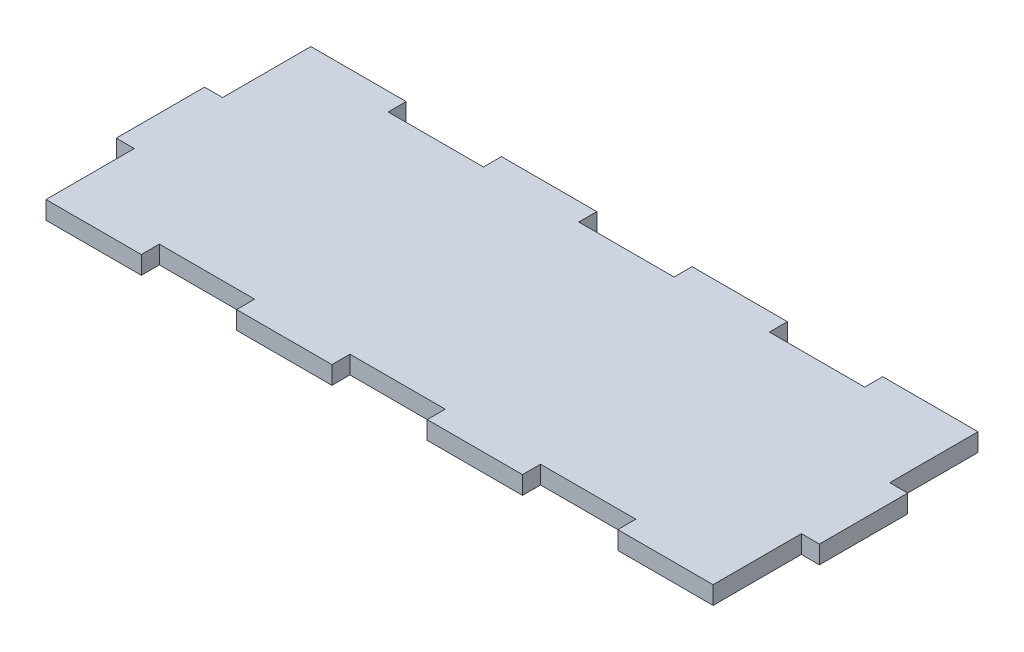
ISO-10303-21;
HEADER;
FILE_DESCRIPTION(('STEP AP214'),'2;1');
FILE_NAME('part.step','',(''),(''),'','','');
FILE_SCHEMA(('AUTOMOTIVE_DESIGN { 1 0 10303 214 1 1 1 1 }'));
ENDSEC;
DATA;
#1=APPLICATION_CONTEXT('core data for automotive mechanical design processes');
#2=APPLICATION_PROTOCOL_DEFINITION('international standard','automotive_design',2000,#1);
#3=PRODUCT_CONTEXT('',#1,'mechanical');
#4=PRODUCT('Part','Part','',(#3));
#5=PRODUCT_RELATED_PRODUCT_CATEGORY('part','',(#4));
#6=PRODUCT_DEFINITION_FORMATION('','',#4);
#7=PRODUCT_DEFINITION_CONTEXT('part definition',#1,'design');
#8=PRODUCT_DEFINITION('design','',#6,#7);
#9=PRODUCT_DEFINITION_SHAPE('','',#8);
#10=(LENGTH_UNIT() NAMED_UNIT(*) SI_UNIT(.MILLI.,.METRE.));
#11=(NAMED_UNIT(*) PLANE_ANGLE_UNIT() SI_UNIT($,.RADIAN.));
#12=(NAMED_UNIT(*) SI_UNIT($,.STERADIAN.) SOLID_ANGLE_UNIT());
#13=UNCERTAINTY_MEASURE_WITH_UNIT(LENGTH_MEASURE(1.E-05),#10,'distance_accuracy_value','');
#14=(GEOMETRIC_REPRESENTATION_CONTEXT(3) GLOBAL_UNCERTAINTY_ASSIGNED_CONTEXT((#13)) GLOBAL_UNIT_ASSIGNED_CONTEXT((#10,
#11,#12)) REPRESENTATION_CONTEXT('',''));
#15=CARTESIAN_POINT('',(0.,0.,0.));
#16=DIRECTION('',(0.,0.,1.));
#17=DIRECTION('',(1.,0.,0.));
#18=AXIS2_PLACEMENT_3D('',#15,#16,#17);
#19=CARTESIAN_POINT('',(68.5,1.85,0.));
#20=DIRECTION('',(-1.,0.,0.));
#21=DIRECTION('',(0.,0.,1.));
#22=AXIS2_PLACEMENT_3D('',#19,#20,#21);
#23=PLANE('',#22);
#24=DIRECTION('',(0.,1.,0.));
#25=VECTOR('',#24,1.);
#26=CARTESIAN_POINT('',(68.5,-9.95905136454435,-16.2833333333333));
#27=LINE('',#26,#25);
#28=CARTESIAN_POINT('',(68.5,0.,-16.2833333333333));
#29=VERTEX_POINT('',#28);
#30=CARTESIAN_POINT('',(68.5,1.85,-16.2833333333333));
#31=VERTEX_POINT('',#30);
#32=EDGE_CURVE('E288',#29,#31,#27,.T.);
#33=ORIENTED_EDGE('',*,*,#32,.F.);
#34=DIRECTION('',(0.,0.,-1.));
#35=VECTOR('',#34,1.);
#36=CARTESIAN_POINT('',(68.5,0.,0.));
#37=LINE('',#36,#35);
#38=CARTESIAN_POINT('',(68.5,0.,-25.35));
#39=VERTEX_POINT('',#38);
#40=EDGE_CURVE('E295',#29,#39,#37,.T.);
#41=ORIENTED_EDGE('',*,*,#40,.T.);
#42=DIRECTION('',(0.,1.,0.));
#43=VECTOR('',#42,1.);
#44=CARTESIAN_POINT('',(68.5,-9.95905136454435,-25.35));
#45=LINE('',#44,#43);
#46=CARTESIAN_POINT('',(68.5,1.85,-25.35));
#47=VERTEX_POINT('',#46);
#48=EDGE_CURVE('E438',#39,#47,#45,.T.);
#49=ORIENTED_EDGE('',*,*,#48,.T.);
#50=DIRECTION('',(0.,0.,-1.));
#51=VECTOR('',#50,1.);
#52=CARTESIAN_POINT('',(68.5,1.85,0.));
#53=LINE('',#52,#51);
#54=EDGE_CURVE('E308',#31,#47,#53,.T.);
#55=ORIENTED_EDGE('',*,*,#54,.F.);
#56=EDGE_LOOP('',(#33,#41,#49,#55));
#57=FACE_BOUND('',#56,.T.);
#58=ADVANCED_FACE('F37',(#57),#23,.F.);
#59=CARTESIAN_POINT('',(0.,1.85,-23.5));
#60=DIRECTION('',(0.,0.,1.));
#61=DIRECTION('',(1.,0.,0.));
#62=AXIS2_PLACEMENT_3D('',#59,#60,#61);
#63=PLANE('',#62);
#64=DIRECTION('',(-1.,0.,0.));
#65=VECTOR('',#64,1.);
#66=CARTESIAN_POINT('',(0.,0.,-23.5));
#67=LINE('',#66,#65);
#68=CARTESIAN_POINT('',(39.1428571428571,0.,-23.5));
#69=VERTEX_POINT('',#68);
#70=CARTESIAN_POINT('',(29.3571428571429,0.,-23.5));
#71=VERTEX_POINT('',#70);
#72=EDGE_CURVE('E296',#69,#71,#67,.T.);
#73=ORIENTED_EDGE('',*,*,#72,.T.);
#74=DIRECTION('',(0.,1.,0.));
#75=VECTOR('',#74,1.);
#76=CARTESIAN_POINT('',(29.3571428571429,-9.95905136454435,-23.5));
#77=LINE('',#76,#75);
#78=CARTESIAN_POINT('',(29.3571428571429,1.85,-23.5));
#79=VERTEX_POINT('',#78);
#80=EDGE_CURVE('E504',#71,#79,#77,.T.);
#81=ORIENTED_EDGE('',*,*,#80,.T.);
#82=DIRECTION('',(-1.,0.,0.));
#83=VECTOR('',#82,1.);
#84=CARTESIAN_POINT('',(0.,1.85,-23.5));
#85=LINE('',#84,#83);
#86=CARTESIAN_POINT('',(39.1428571428571,1.85,-23.5));
#87=VERTEX_POINT('',#86);
#88=EDGE_CURVE('E46',#87,#79,#85,.T.);
#89=ORIENTED_EDGE('',*,*,#88,.F.);
#90=DIRECTION('',(0.,1.,0.));
#91=VECTOR('',#90,1.);
#92=CARTESIAN_POINT('',(39.1428571428571,-9.95905136454435,-23.5));
#93=LINE('',#92,#91);
#94=EDGE_CURVE('E471',#69,#87,#93,.T.);
#95=ORIENTED_EDGE('',*,*,#94,.F.);
#96=EDGE_LOOP('',(#73,#81,#89,#95));
#97=FACE_BOUND('',#96,.T.);
#98=ADVANCED_FACE('F647',(#97),#63,.F.);
#99=CARTESIAN_POINT('',(58.7142857142857,0.,-23.5));
#100=VERTEX_POINT('',#99);
#101=CARTESIAN_POINT('',(48.9285714285714,0.,-23.5));
#102=VERTEX_POINT('',#101);
#103=EDGE_CURVE('E41',#100,#102,#67,.T.);
#104=ORIENTED_EDGE('',*,*,#103,.T.);
#105=DIRECTION('',(0.,1.,0.));
#106=VECTOR('',#105,1.);
#107=CARTESIAN_POINT('',(48.9285714285714,-9.95905136454435,-23.5));
#108=LINE('',#107,#106);
#109=CARTESIAN_POINT('',(48.9285714285714,1.85,-23.5));
#110=VERTEX_POINT('',#109);
#111=EDGE_CURVE('E477',#102,#110,#108,.T.);
#112=ORIENTED_EDGE('',*,*,#111,.T.);
#113=CARTESIAN_POINT('',(58.7142857142857,1.85,-23.5));
#114=VERTEX_POINT('',#113);
#115=EDGE_CURVE('E11',#114,#110,#85,.T.);
#116=ORIENTED_EDGE('',*,*,#115,.F.);
#117=DIRECTION('',(0.,1.,0.));
#118=VECTOR('',#117,1.);
#119=CARTESIAN_POINT('',(58.7142857142857,-9.95905136454435,-23.5));
#120=LINE('',#119,#118);
#121=EDGE_CURVE('E445',#100,#114,#120,.T.);
#122=ORIENTED_EDGE('',*,*,#121,.F.);
#123=EDGE_LOOP('',(#104,#112,#116,#122));
#124=FACE_BOUND('',#123,.T.);
#125=ADVANCED_FACE('F645',(#124),#63,.F.);
#126=CARTESIAN_POINT('',(19.5714285714286,0.,-23.5));
#127=VERTEX_POINT('',#126);
#128=CARTESIAN_POINT('',(9.78571428571429,0.,-23.5));
#129=VERTEX_POINT('',#128);
#130=EDGE_CURVE('E294',#127,#129,#67,.T.);
#131=ORIENTED_EDGE('',*,*,#130,.T.);
#132=DIRECTION('',(0.,1.,0.));
#133=VECTOR('',#132,1.);
#134=CARTESIAN_POINT('',(9.78571428571429,-9.95905136454435,-23.5));
#135=LINE('',#134,#133);
#136=CARTESIAN_POINT('',(9.78571428571429,1.85,-23.5));
#137=VERTEX_POINT('',#136);
#138=EDGE_CURVE('E63',#129,#137,#135,.T.);
#139=ORIENTED_EDGE('',*,*,#138,.T.);
#140=CARTESIAN_POINT('',(19.5714285714286,1.85,-23.5));
#141=VERTEX_POINT('',#140);
#142=EDGE_CURVE('E48',#141,#137,#85,.T.);
#143=ORIENTED_EDGE('',*,*,#142,.F.);
#144=DIRECTION('',(0.,1.,0.));
#145=VECTOR('',#144,1.);
#146=CARTESIAN_POINT('',(19.5714285714286,-9.95905136454435,-23.5));
#147=LINE('',#146,#145);
#148=EDGE_CURVE('E498',#127,#141,#147,.T.);
#149=ORIENTED_EDGE('',*,*,#148,.F.);
#150=EDGE_LOOP('',(#131,#139,#143,#149));
#151=FACE_BOUND('',#150,.T.);
#152=ADVANCED_FACE('F643',(#151),#63,.F.);
#153=CARTESIAN_POINT('',(0.,1.85,0.));
#154=DIRECTION('',(0.,0.,-1.));
#155=DIRECTION('',(-1.,0.,0.));
#156=AXIS2_PLACEMENT_3D('',#153,#154,#155);
#157=PLANE('',#156);
#158=DIRECTION('',(1.,0.,0.));
#159=VECTOR('',#158,1.);
#160=CARTESIAN_POINT('',(0.,0.,0.));
#161=LINE('',#160,#159);
#162=CARTESIAN_POINT('',(48.9285714285714,0.,0.));
#163=VERTEX_POINT('',#162);
#164=CARTESIAN_POINT('',(58.7142857142857,0.,0.));
#165=VERTEX_POINT('',#164);
#166=EDGE_CURVE('E301',#163,#165,#161,.T.);
#167=ORIENTED_EDGE('',*,*,#166,.T.);
#168=DIRECTION('',(0.,1.,0.));
#169=VECTOR('',#168,1.);
#170=CARTESIAN_POINT('',(58.7142857142857,-9.95905136454435,0.));
#171=LINE('',#170,#169);
#172=CARTESIAN_POINT('',(58.7142857142857,1.85,0.));
#173=VERTEX_POINT('',#172);
#174=EDGE_CURVE('E429',#165,#173,#171,.T.);
#175=ORIENTED_EDGE('',*,*,#174,.T.);
#176=DIRECTION('',(1.,0.,0.));
#177=VECTOR('',#176,1.);
#178=CARTESIAN_POINT('',(0.,1.85,0.));
#179=LINE('',#178,#177);
#180=CARTESIAN_POINT('',(48.9285714285714,1.85,0.));
#181=VERTEX_POINT('',#180);
#182=EDGE_CURVE('E313',#181,#173,#179,.T.);
#183=ORIENTED_EDGE('',*,*,#182,.F.);
#184=DIRECTION('',(0.,1.,0.));
#185=VECTOR('',#184,1.);
#186=CARTESIAN_POINT('',(48.9285714285714,-9.95905136454435,0.));
#187=LINE('',#186,#185);
#188=EDGE_CURVE('E412',#163,#181,#187,.T.);
#189=ORIENTED_EDGE('',*,*,#188,.F.);
#190=EDGE_LOOP('',(#167,#175,#183,#189));
#191=FACE_BOUND('',#190,.T.);
#192=ADVANCED_FACE('F556',(#191),#157,.F.);
#193=CARTESIAN_POINT('',(29.3571428571429,0.,0.));
#194=VERTEX_POINT('',#193);
#195=CARTESIAN_POINT('',(39.1428571428571,0.,0.));
#196=VERTEX_POINT('',#195);
#197=EDGE_CURVE('E300',#194,#196,#161,.T.);
#198=ORIENTED_EDGE('',*,*,#197,.T.);
#199=DIRECTION('',(0.,1.,0.));
#200=VECTOR('',#199,1.);
#201=CARTESIAN_POINT('',(39.1428571428571,-9.95905136454435,0.));
#202=LINE('',#201,#200);
#203=CARTESIAN_POINT('',(39.1428571428571,1.85,0.));
#204=VERTEX_POINT('',#203);
#205=EDGE_CURVE('E407',#196,#204,#202,.T.);
#206=ORIENTED_EDGE('',*,*,#205,.T.);
#207=CARTESIAN_POINT('',(29.3571428571429,1.85,0.));
#208=VERTEX_POINT('',#207);
#209=EDGE_CURVE('E312',#208,#204,#179,.T.);
#210=ORIENTED_EDGE('',*,*,#209,.F.);
#211=DIRECTION('',(0.,1.,0.));
#212=VECTOR('',#211,1.);
#213=CARTESIAN_POINT('',(29.3571428571429,-9.95905136454435,0.));
#214=LINE('',#213,#212);
#215=EDGE_CURVE('E376',#194,#208,#214,.T.);
#216=ORIENTED_EDGE('',*,*,#215,.F.);
#217=EDGE_LOOP('',(#198,#206,#210,#216));
#218=FACE_BOUND('',#217,.T.);
#219=ADVANCED_FACE('F575',(#218),#157,.F.);
#220=CARTESIAN_POINT('',(0.,1.85,0.));
#221=DIRECTION('',(1.,0.,0.));
#222=DIRECTION('',(0.,0.,-1.));
#223=AXIS2_PLACEMENT_3D('',#220,#221,#222);
#224=PLANE('',#223);
#225=DIRECTION('',(0.,1.,0.));
#226=VECTOR('',#225,1.);
#227=CARTESIAN_POINT('',(0.,-9.95905136454435,-7.21666666666667));
#228=LINE('',#227,#226);
#229=CARTESIAN_POINT('',(0.,0.,-7.21666666666667));
#230=VERTEX_POINT('',#229);
#231=CARTESIAN_POINT('',(0.,1.85,-7.21666666666667));
#232=VERTEX_POINT('',#231);
#233=EDGE_CURVE('E354',#230,#232,#228,.T.);
#234=ORIENTED_EDGE('',*,*,#233,.F.);
#235=DIRECTION('',(0.,0.,1.));
#236=VECTOR('',#235,1.);
#237=CARTESIAN_POINT('',(0.,0.,0.));
#238=LINE('',#237,#236);
#239=CARTESIAN_POINT('',(0.,0.,1.85));
#240=VERTEX_POINT('',#239);
#241=EDGE_CURVE('E304',#230,#240,#238,.T.);
#242=ORIENTED_EDGE('',*,*,#241,.T.);
#243=DIRECTION('',(0.,1.,0.));
#244=VECTOR('',#243,1.);
#245=CARTESIAN_POINT('',(0.,-9.95905136454435,1.85));
#246=LINE('',#245,#244);
#247=CARTESIAN_POINT('',(0.,1.85,1.85));
#248=VERTEX_POINT('',#247);
#249=EDGE_CURVE('E318',#240,#248,#246,.T.);
#250=ORIENTED_EDGE('',*,*,#249,.T.);
#251=DIRECTION('',(0.,0.,1.));
#252=VECTOR('',#251,1.);
#253=CARTESIAN_POINT('',(0.,1.85,0.));
#254=LINE('',#253,#252);
#255=EDGE_CURVE('E317',#232,#248,#254,.T.);
#256=ORIENTED_EDGE('',*,*,#255,.F.);
#257=EDGE_LOOP('',(#234,#242,#250,#256));
#258=FACE_BOUND('',#257,.T.);
#259=ADVANCED_FACE('F603',(#258),#224,.F.);
#260=CARTESIAN_POINT('',(9.78571428571429,0.,0.));
#261=VERTEX_POINT('',#260);
#262=CARTESIAN_POINT('',(19.5714285714286,0.,0.));
#263=VERTEX_POINT('',#262);
#264=EDGE_CURVE('E297',#261,#263,#161,.T.);
#265=ORIENTED_EDGE('',*,*,#264,.T.);
#266=DIRECTION('',(0.,1.,0.));
#267=VECTOR('',#266,1.);
#268=CARTESIAN_POINT('',(19.5714285714286,-9.95905136454435,0.));
#269=LINE('',#268,#267);
#270=CARTESIAN_POINT('',(19.5714285714286,1.85,0.));
#271=VERTEX_POINT('',#270);
#272=EDGE_CURVE('E385',#263,#271,#269,.T.);
#273=ORIENTED_EDGE('',*,*,#272,.T.);
#274=CARTESIAN_POINT('',(9.78571428571429,1.85,0.));
#275=VERTEX_POINT('',#274);
#276=EDGE_CURVE('E309',#275,#271,#179,.T.);
#277=ORIENTED_EDGE('',*,*,#276,.F.);
#278=DIRECTION('',(0.,1.,0.));
#279=VECTOR('',#278,1.);
#280=CARTESIAN_POINT('',(9.78571428571429,-9.95905136454435,0.));
#281=LINE('',#280,#279);
#282=EDGE_CURVE('E321',#261,#275,#281,.T.);
#283=ORIENTED_EDGE('',*,*,#282,.F.);
#284=EDGE_LOOP('',(#265,#273,#277,#283));
#285=FACE_BOUND('',#284,.T.);
#286=ADVANCED_FACE('F652',(#285),#157,.F.);
#287=CARTESIAN_POINT('',(0.,0.,-25.35));
#288=VERTEX_POINT('',#287);
#289=CARTESIAN_POINT('',(0.,0.,-16.2833333333333));
#290=VERTEX_POINT('',#289);
#291=EDGE_CURVE('E302',#288,#290,#238,.T.);
#292=ORIENTED_EDGE('',*,*,#291,.T.);
#293=DIRECTION('',(0.,1.,0.));
#294=VECTOR('',#293,1.);
#295=CARTESIAN_POINT('',(0.,-9.95905136454435,-16.2833333333333));
#296=LINE('',#295,#294);
#297=CARTESIAN_POINT('',(0.,1.85,-16.2833333333333));
#298=VERTEX_POINT('',#297);
#299=EDGE_CURVE('E359',#290,#298,#296,.T.);
#300=ORIENTED_EDGE('',*,*,#299,.T.);
#301=CARTESIAN_POINT('',(0.,1.85,-25.35));
#302=VERTEX_POINT('',#301);
#303=EDGE_CURVE('E314',#302,#298,#254,.T.);
#304=ORIENTED_EDGE('',*,*,#303,.F.);
#305=DIRECTION('',(0.,1.,0.));
#306=VECTOR('',#305,1.);
#307=CARTESIAN_POINT('',(0.,-9.95905136454435,-25.35));
#308=LINE('',#307,#306);
#309=EDGE_CURVE('E518',#288,#302,#308,.T.);
#310=ORIENTED_EDGE('',*,*,#309,.F.);
#311=EDGE_LOOP('',(#292,#300,#304,#310));
#312=FACE_BOUND('',#311,.T.);
#313=ADVANCED_FACE('F39',(#312),#224,.F.);
#314=CARTESIAN_POINT('',(68.5,0.,1.85));
#315=VERTEX_POINT('',#314);
#316=CARTESIAN_POINT('',(68.5,0.,-7.21666666666667));
#317=VERTEX_POINT('',#316);
#318=EDGE_CURVE('E276',#315,#317,#37,.T.);
#319=ORIENTED_EDGE('',*,*,#318,.T.);
#320=DIRECTION('',(0.,1.,0.));
#321=VECTOR('',#320,1.);
#322=CARTESIAN_POINT('',(68.5,-9.95905136454435,-7.21666666666667));
#323=LINE('',#322,#321);
#324=CARTESIAN_POINT('',(68.5,1.85,-7.21666666666667));
#325=VERTEX_POINT('',#324);
#326=EDGE_CURVE('E284',#317,#325,#323,.T.);
#327=ORIENTED_EDGE('',*,*,#326,.T.);
#328=CARTESIAN_POINT('',(68.5,1.85,1.85));
#329=VERTEX_POINT('',#328);
#330=EDGE_CURVE('E306',#329,#325,#53,.T.);
#331=ORIENTED_EDGE('',*,*,#330,.F.);
#332=DIRECTION('',(0.,1.,0.));
#333=VECTOR('',#332,1.);
#334=CARTESIAN_POINT('',(68.5,-9.95905136454435,1.85));
#335=LINE('',#334,#333);
#336=EDGE_CURVE('E292',#315,#329,#335,.T.);
#337=ORIENTED_EDGE('',*,*,#336,.F.);
#338=EDGE_LOOP('',(#319,#327,#331,#337));
#339=FACE_BOUND('',#338,.T.);
#340=ADVANCED_FACE('F290',(#339),#23,.F.);
#341=CARTESIAN_POINT('',(0.,1.85,0.));
#342=DIRECTION('',(0.,-1.,0.));
#343=DIRECTION('',(0.,0.,-1.));
#344=AXIS2_PLACEMENT_3D('',#341,#342,#343);
#345=PLANE('',#344);
#346=ORIENTED_EDGE('',*,*,#303,.T.);
#347=DIRECTION('',(-1.,0.,0.));
#348=VECTOR('',#347,1.);
#349=CARTESIAN_POINT('',(0.,1.85,-16.2833333333333));
#350=LINE('',#349,#348);
#351=CARTESIAN_POINT('',(-1.85,1.85,-16.2833333333333));
#352=VERTEX_POINT('',#351);
#353=EDGE_CURVE('E336',#298,#352,#350,.T.);
#354=ORIENTED_EDGE('',*,*,#353,.T.);
#355=DIRECTION('',(0.,0.,1.));
#356=VECTOR('',#355,1.);
#357=CARTESIAN_POINT('',(-1.85,1.85,-16.2833333333333));
#358=LINE('',#357,#356);
#359=CARTESIAN_POINT('',(-1.85,1.85,-7.21666666666667));
#360=VERTEX_POINT('',#359);
#361=EDGE_CURVE('E342',#352,#360,#358,.T.);
#362=ORIENTED_EDGE('',*,*,#361,.T.);
#363=DIRECTION('',(1.,0.,0.));
#364=VECTOR('',#363,1.);
#365=CARTESIAN_POINT('',(0.,1.85,-7.21666666666667));
#366=LINE('',#365,#364);
#367=EDGE_CURVE('E339',#360,#232,#366,.T.);
#368=ORIENTED_EDGE('',*,*,#367,.T.);
#369=ORIENTED_EDGE('',*,*,#255,.T.);
#370=DIRECTION('',(1.,0.,0.));
#371=VECTOR('',#370,1.);
#372=CARTESIAN_POINT('',(0.,1.85,1.85));
#373=LINE('',#372,#371);
#374=CARTESIAN_POINT('',(9.78571428571429,1.85,1.85));
#375=VERTEX_POINT('',#374);
#376=EDGE_CURVE('E333',#248,#375,#373,.T.);
#377=ORIENTED_EDGE('',*,*,#376,.T.);
#378=DIRECTION('',(0.,0.,-1.));
#379=VECTOR('',#378,1.);
#380=CARTESIAN_POINT('',(9.78571428571429,1.85,0.));
#381=LINE('',#380,#379);
#382=EDGE_CURVE('E332',#375,#275,#381,.T.);
#383=ORIENTED_EDGE('',*,*,#382,.T.);
#384=ORIENTED_EDGE('',*,*,#276,.T.);
#385=DIRECTION('',(0.,0.,1.));
#386=VECTOR('',#385,1.);
#387=CARTESIAN_POINT('',(19.5714285714286,1.85,0.));
#388=LINE('',#387,#386);
#389=CARTESIAN_POINT('',(19.5714285714286,1.85,1.85));
#390=VERTEX_POINT('',#389);
#391=EDGE_CURVE('E365',#271,#390,#388,.T.);
#392=ORIENTED_EDGE('',*,*,#391,.T.);
#393=DIRECTION('',(1.,0.,0.));
#394=VECTOR('',#393,1.);
#395=CARTESIAN_POINT('',(19.5714285714286,1.85,1.85));
#396=LINE('',#395,#394);
#397=CARTESIAN_POINT('',(29.3571428571429,1.85,1.85));
#398=VERTEX_POINT('',#397);
#399=EDGE_CURVE('E364',#390,#398,#396,.T.);
#400=ORIENTED_EDGE('',*,*,#399,.T.);
#401=DIRECTION('',(0.,0.,-1.));
#402=VECTOR('',#401,1.);
#403=CARTESIAN_POINT('',(29.3571428571429,1.85,0.));
#404=LINE('',#403,#402);
#405=EDGE_CURVE('E368',#398,#208,#404,.T.);
#406=ORIENTED_EDGE('',*,*,#405,.T.);
#407=ORIENTED_EDGE('',*,*,#209,.T.);
#408=DIRECTION('',(0.,0.,1.));
#409=VECTOR('',#408,1.);
#410=CARTESIAN_POINT('',(39.1428571428571,1.85,0.));
#411=LINE('',#410,#409);
#412=CARTESIAN_POINT('',(39.1428571428571,1.85,1.85));
#413=VERTEX_POINT('',#412);
#414=EDGE_CURVE('E391',#204,#413,#411,.T.);
#415=ORIENTED_EDGE('',*,*,#414,.T.);
#416=DIRECTION('',(1.,0.,0.));
#417=VECTOR('',#416,1.);
#418=CARTESIAN_POINT('',(39.1428571428571,1.85,1.85));
#419=LINE('',#418,#417);
#420=CARTESIAN_POINT('',(48.9285714285714,1.85,1.85));
#421=VERTEX_POINT('',#420);
#422=EDGE_CURVE('E395',#413,#421,#419,.T.);
#423=ORIENTED_EDGE('',*,*,#422,.T.);
#424=DIRECTION('',(0.,0.,-1.));
#425=VECTOR('',#424,1.);
#426=CARTESIAN_POINT('',(48.9285714285714,1.85,0.));
#427=LINE('',#426,#425);
#428=EDGE_CURVE('E392',#421,#181,#427,.T.);
#429=ORIENTED_EDGE('',*,*,#428,.T.);
#430=ORIENTED_EDGE('',*,*,#182,.T.);
#431=DIRECTION('',(0.,0.,1.));
#432=VECTOR('',#431,1.);
#433=CARTESIAN_POINT('',(58.7142857142857,1.85,0.));
#434=LINE('',#433,#432);
#435=CARTESIAN_POINT('',(58.7142857142857,1.85,1.85));
#436=VERTEX_POINT('',#435);
#437=EDGE_CURVE('E418',#173,#436,#434,.T.);
#438=ORIENTED_EDGE('',*,*,#437,.T.);
#439=DIRECTION('',(1.,0.,0.));
#440=VECTOR('',#439,1.);
#441=CARTESIAN_POINT('',(58.7142857142857,1.85,1.85));
#442=LINE('',#441,#440);
#443=EDGE_CURVE('E419',#436,#329,#442,.T.);
#444=ORIENTED_EDGE('',*,*,#443,.T.);
#445=ORIENTED_EDGE('',*,*,#330,.T.);
#446=DIRECTION('',(1.,0.,0.));
#447=VECTOR('',#446,1.);
#448=CARTESIAN_POINT('',(68.5,1.85,-7.21666666666667));
#449=LINE('',#448,#447);
#450=CARTESIAN_POINT('',(70.35,1.85,-7.21666666666667));
#451=VERTEX_POINT('',#450);
#452=EDGE_CURVE('E55',#325,#451,#449,.T.);
#453=ORIENTED_EDGE('',*,*,#452,.T.);
#454=DIRECTION('',(0.,0.,-1.));
#455=VECTOR('',#454,1.);
#456=CARTESIAN_POINT('',(70.35,1.85,-16.2833333333333));
#457=LINE('',#456,#455);
#458=CARTESIAN_POINT('',(70.35,1.85,-16.2833333333333));
#459=VERTEX_POINT('',#458);
#460=EDGE_CURVE('E528',#451,#459,#457,.T.);
#461=ORIENTED_EDGE('',*,*,#460,.T.);
#462=DIRECTION('',(-1.,0.,0.));
#463=VECTOR('',#462,1.);
#464=CARTESIAN_POINT('',(68.5,1.85,-16.2833333333333));
#465=LINE('',#464,#463);
#466=EDGE_CURVE('E281',#459,#31,#465,.T.);
#467=ORIENTED_EDGE('',*,*,#466,.T.);
#468=ORIENTED_EDGE('',*,*,#54,.T.);
#469=DIRECTION('',(-1.,0.,0.));
#470=VECTOR('',#469,1.);
#471=CARTESIAN_POINT('',(58.7142857142857,1.85,-25.35));
#472=LINE('',#471,#470);
#473=CARTESIAN_POINT('',(58.7142857142857,1.85,-25.35));
#474=VERTEX_POINT('',#473);
#475=EDGE_CURVE('E434',#47,#474,#472,.T.);
#476=ORIENTED_EDGE('',*,*,#475,.T.);
#477=DIRECTION('',(0.,0.,1.));
#478=VECTOR('',#477,1.);
#479=CARTESIAN_POINT('',(58.7142857142857,1.85,-23.5));
#480=LINE('',#479,#478);
#481=EDGE_CURVE('E435',#474,#114,#480,.T.);
#482=ORIENTED_EDGE('',*,*,#481,.T.);
#483=ORIENTED_EDGE('',*,*,#115,.T.);
#484=DIRECTION('',(0.,0.,-1.));
#485=VECTOR('',#484,1.);
#486=CARTESIAN_POINT('',(48.9285714285714,1.85,-23.5));
#487=LINE('',#486,#485);
#488=CARTESIAN_POINT('',(48.9285714285714,1.85,-25.35));
#489=VERTEX_POINT('',#488);
#490=EDGE_CURVE('E451',#110,#489,#487,.T.);
#491=ORIENTED_EDGE('',*,*,#490,.T.);
#492=DIRECTION('',(-1.,0.,0.));
#493=VECTOR('',#492,1.);
#494=CARTESIAN_POINT('',(39.1428571428571,1.85,-25.35));
#495=LINE('',#494,#493);
#496=CARTESIAN_POINT('',(39.1428571428571,1.85,-25.35));
#497=VERTEX_POINT('',#496);
#498=EDGE_CURVE('E458',#489,#497,#495,.T.);
#499=ORIENTED_EDGE('',*,*,#498,.T.);
#500=DIRECTION('',(0.,0.,1.));
#501=VECTOR('',#500,1.);
#502=CARTESIAN_POINT('',(39.1428571428571,1.85,-23.5));
#503=LINE('',#502,#501);
#504=EDGE_CURVE('E455',#497,#87,#503,.T.);
#505=ORIENTED_EDGE('',*,*,#504,.T.);
#506=ORIENTED_EDGE('',*,*,#88,.T.);
#507=DIRECTION('',(0.,0.,-1.));
#508=VECTOR('',#507,1.);
#509=CARTESIAN_POINT('',(29.3571428571429,1.85,-23.5));
#510=LINE('',#509,#508);
#511=CARTESIAN_POINT('',(29.3571428571429,1.85,-25.35));
#512=VERTEX_POINT('',#511);
#513=EDGE_CURVE('E481',#79,#512,#510,.T.);
#514=ORIENTED_EDGE('',*,*,#513,.T.);
#515=DIRECTION('',(-1.,0.,0.));
#516=VECTOR('',#515,1.);
#517=CARTESIAN_POINT('',(19.5714285714286,1.85,-25.35));
#518=LINE('',#517,#516);
#519=CARTESIAN_POINT('',(19.5714285714286,1.85,-25.35));
#520=VERTEX_POINT('',#519);
#521=EDGE_CURVE('E485',#512,#520,#518,.T.);
#522=ORIENTED_EDGE('',*,*,#521,.T.);
#523=DIRECTION('',(0.,0.,1.));
#524=VECTOR('',#523,1.);
#525=CARTESIAN_POINT('',(19.5714285714286,1.85,-23.5));
#526=LINE('',#525,#524);
#527=EDGE_CURVE('E482',#520,#141,#526,.T.);
#528=ORIENTED_EDGE('',*,*,#527,.T.);
#529=ORIENTED_EDGE('',*,*,#142,.T.);
#530=DIRECTION('',(0.,0.,-1.));
#531=VECTOR('',#530,1.);
#532=CARTESIAN_POINT('',(9.78571428571429,1.85,-23.5));
#533=LINE('',#532,#531);
#534=CARTESIAN_POINT('',(9.78571428571429,1.85,-25.35));
#535=VERTEX_POINT('',#534);
#536=EDGE_CURVE('E508',#137,#535,#533,.T.);
#537=ORIENTED_EDGE('',*,*,#536,.T.);
#538=DIRECTION('',(-1.,0.,0.));
#539=VECTOR('',#538,1.);
#540=CARTESIAN_POINT('',(0.,1.85,-25.35));
#541=LINE('',#540,#539);
#542=EDGE_CURVE('E509',#535,#302,#541,.T.);
#543=ORIENTED_EDGE('',*,*,#542,.T.);
#544=EDGE_LOOP('',(#346,#354,#362,#368,#369,#377,#383,#384,#392,#400,#406,#407,#415,#423,#429,
#430,#438,#444,#445,#453,#461,#467,#468,#476,#482,#483,#491,#499,#505,#506,#514,#522,#528,#529,
#537,#543));
#545=FACE_BOUND('',#544,.T.);
#546=ADVANCED_FACE('F544',(#545),#345,.F.);
#547=CARTESIAN_POINT('',(0.,0.,0.));
#548=DIRECTION('',(0.,-1.,0.));
#549=DIRECTION('',(0.,0.,-1.));
#550=AXIS2_PLACEMENT_3D('',#547,#548,#549);
#551=PLANE('',#550);
#552=ORIENTED_EDGE('',*,*,#291,.F.);
#553=DIRECTION('',(-1.,0.,0.));
#554=VECTOR('',#553,1.);
#555=CARTESIAN_POINT('',(0.,0.,-25.35));
#556=LINE('',#555,#554);
#557=CARTESIAN_POINT('',(9.78571428571429,0.,-25.35));
#558=VERTEX_POINT('',#557);
#559=EDGE_CURVE('E514',#558,#288,#556,.T.);
#560=ORIENTED_EDGE('',*,*,#559,.F.);
#561=DIRECTION('',(0.,0.,-1.));
#562=VECTOR('',#561,1.);
#563=CARTESIAN_POINT('',(9.78571428571429,0.,-23.5));
#564=LINE('',#563,#562);
#565=EDGE_CURVE('E519',#129,#558,#564,.T.);
#566=ORIENTED_EDGE('',*,*,#565,.F.);
#567=ORIENTED_EDGE('',*,*,#130,.F.);
#568=DIRECTION('',(0.,0.,1.));
#569=VECTOR('',#568,1.);
#570=CARTESIAN_POINT('',(19.5714285714286,0.,-23.5));
#571=LINE('',#570,#569);
#572=CARTESIAN_POINT('',(19.5714285714286,0.,-25.35));
#573=VERTEX_POINT('',#572);
#574=EDGE_CURVE('E494',#573,#127,#571,.T.);
#575=ORIENTED_EDGE('',*,*,#574,.F.);
#576=DIRECTION('',(-1.,0.,0.));
#577=VECTOR('',#576,1.);
#578=CARTESIAN_POINT('',(19.5714285714286,0.,-25.35));
#579=LINE('',#578,#577);
#580=CARTESIAN_POINT('',(29.3571428571429,0.,-25.35));
#581=VERTEX_POINT('',#580);
#582=EDGE_CURVE('E499',#581,#573,#579,.T.);
#583=ORIENTED_EDGE('',*,*,#582,.F.);
#584=DIRECTION('',(0.,0.,-1.));
#585=VECTOR('',#584,1.);
#586=CARTESIAN_POINT('',(29.3571428571429,0.,-23.5));
#587=LINE('',#586,#585);
#588=EDGE_CURVE('E486',#71,#581,#587,.T.);
#589=ORIENTED_EDGE('',*,*,#588,.F.);
#590=ORIENTED_EDGE('',*,*,#72,.F.);
#591=DIRECTION('',(0.,0.,1.));
#592=VECTOR('',#591,1.);
#593=CARTESIAN_POINT('',(39.1428571428571,0.,-23.5));
#594=LINE('',#593,#592);
#595=CARTESIAN_POINT('',(39.1428571428571,0.,-25.35));
#596=VERTEX_POINT('',#595);
#597=EDGE_CURVE('E467',#596,#69,#594,.T.);
#598=ORIENTED_EDGE('',*,*,#597,.F.);
#599=DIRECTION('',(-1.,0.,0.));
#600=VECTOR('',#599,1.);
#601=CARTESIAN_POINT('',(39.1428571428571,0.,-25.35));
#602=LINE('',#601,#600);
#603=CARTESIAN_POINT('',(48.9285714285714,0.,-25.35));
#604=VERTEX_POINT('',#603);
#605=EDGE_CURVE('E472',#604,#596,#602,.T.);
#606=ORIENTED_EDGE('',*,*,#605,.F.);
#607=DIRECTION('',(0.,0.,-1.));
#608=VECTOR('',#607,1.);
#609=CARTESIAN_POINT('',(48.9285714285714,0.,-23.5));
#610=LINE('',#609,#608);
#611=EDGE_CURVE('E459',#102,#604,#610,.T.);
#612=ORIENTED_EDGE('',*,*,#611,.F.);
#613=ORIENTED_EDGE('',*,*,#103,.F.);
#614=DIRECTION('',(0.,0.,1.));
#615=VECTOR('',#614,1.);
#616=CARTESIAN_POINT('',(58.7142857142857,0.,-23.5));
#617=LINE('',#616,#615);
#618=CARTESIAN_POINT('',(58.7142857142857,0.,-25.35));
#619=VERTEX_POINT('',#618);
#620=EDGE_CURVE('E441',#619,#100,#617,.T.);
#621=ORIENTED_EDGE('',*,*,#620,.F.);
#622=DIRECTION('',(-1.,0.,0.));
#623=VECTOR('',#622,1.);
#624=CARTESIAN_POINT('',(58.7142857142857,0.,-25.35));
#625=LINE('',#624,#623);
#626=EDGE_CURVE('E446',#39,#619,#625,.T.);
#627=ORIENTED_EDGE('',*,*,#626,.F.);
#628=ORIENTED_EDGE('',*,*,#40,.F.);
#629=DIRECTION('',(-1.,0.,0.));
#630=VECTOR('',#629,1.);
#631=CARTESIAN_POINT('',(68.5,0.,-16.2833333333333));
#632=LINE('',#631,#630);
#633=CARTESIAN_POINT('',(70.35,0.,-16.2833333333333));
#634=VERTEX_POINT('',#633);
#635=EDGE_CURVE('E532',#634,#29,#632,.T.);
#636=ORIENTED_EDGE('',*,*,#635,.F.);
#637=DIRECTION('',(0.,0.,-1.));
#638=VECTOR('',#637,1.);
#639=CARTESIAN_POINT('',(70.35,0.,-16.2833333333333));
#640=LINE('',#639,#638);
#641=CARTESIAN_POINT('',(70.35,0.,-7.21666666666667));
#642=VERTEX_POINT('',#641);
#643=EDGE_CURVE('E279',#642,#634,#640,.T.);
#644=ORIENTED_EDGE('',*,*,#643,.F.);
#645=DIRECTION('',(1.,0.,0.));
#646=VECTOR('',#645,1.);
#647=CARTESIAN_POINT('',(68.5,0.,-7.21666666666667));
#648=LINE('',#647,#646);
#649=EDGE_CURVE('E273',#317,#642,#648,.T.);
#650=ORIENTED_EDGE('',*,*,#649,.F.);
#651=ORIENTED_EDGE('',*,*,#318,.F.);
#652=DIRECTION('',(1.,0.,0.));
#653=VECTOR('',#652,1.);
#654=CARTESIAN_POINT('',(58.7142857142857,0.,1.85));
#655=LINE('',#654,#653);
#656=CARTESIAN_POINT('',(58.7142857142857,0.,1.85));
#657=VERTEX_POINT('',#656);
#658=EDGE_CURVE('E422',#657,#315,#655,.T.);
#659=ORIENTED_EDGE('',*,*,#658,.F.);
#660=DIRECTION('',(0.,0.,1.));
#661=VECTOR('',#660,1.);
#662=CARTESIAN_POINT('',(58.7142857142857,0.,0.));
#663=LINE('',#662,#661);
#664=EDGE_CURVE('E426',#165,#657,#663,.T.);
#665=ORIENTED_EDGE('',*,*,#664,.F.);
#666=ORIENTED_EDGE('',*,*,#166,.F.);
#667=DIRECTION('',(0.,0.,-1.));
#668=VECTOR('',#667,1.);
#669=CARTESIAN_POINT('',(48.9285714285714,0.,0.));
#670=LINE('',#669,#668);
#671=CARTESIAN_POINT('',(48.9285714285714,0.,1.85));
#672=VERTEX_POINT('',#671);
#673=EDGE_CURVE('E409',#672,#163,#670,.T.);
#674=ORIENTED_EDGE('',*,*,#673,.F.);
#675=DIRECTION('',(1.,0.,0.));
#676=VECTOR('',#675,1.);
#677=CARTESIAN_POINT('',(39.1428571428571,0.,1.85));
#678=LINE('',#677,#676);
#679=CARTESIAN_POINT('',(39.1428571428571,0.,1.85));
#680=VERTEX_POINT('',#679);
#681=EDGE_CURVE('E396',#680,#672,#678,.T.);
#682=ORIENTED_EDGE('',*,*,#681,.F.);
#683=DIRECTION('',(0.,0.,1.));
#684=VECTOR('',#683,1.);
#685=CARTESIAN_POINT('',(39.1428571428571,0.,0.));
#686=LINE('',#685,#684);
#687=EDGE_CURVE('E404',#196,#680,#686,.T.);
#688=ORIENTED_EDGE('',*,*,#687,.F.);
#689=ORIENTED_EDGE('',*,*,#197,.F.);
#690=DIRECTION('',(0.,0.,-1.));
#691=VECTOR('',#690,1.);
#692=CARTESIAN_POINT('',(29.3571428571429,0.,0.));
#693=LINE('',#692,#691);
#694=CARTESIAN_POINT('',(29.3571428571429,0.,1.85));
#695=VERTEX_POINT('',#694);
#696=EDGE_CURVE('E369',#695,#194,#693,.T.);
#697=ORIENTED_EDGE('',*,*,#696,.F.);
#698=DIRECTION('',(1.,0.,0.));
#699=VECTOR('',#698,1.);
#700=CARTESIAN_POINT('',(19.5714285714286,0.,1.85));
#701=LINE('',#700,#699);
#702=CARTESIAN_POINT('',(19.5714285714286,0.,1.85));
#703=VERTEX_POINT('',#702);
#704=EDGE_CURVE('E377',#703,#695,#701,.T.);
#705=ORIENTED_EDGE('',*,*,#704,.F.);
#706=DIRECTION('',(0.,0.,1.));
#707=VECTOR('',#706,1.);
#708=CARTESIAN_POINT('',(19.5714285714286,0.,0.));
#709=LINE('',#708,#707);
#710=EDGE_CURVE('E382',#263,#703,#709,.T.);
#711=ORIENTED_EDGE('',*,*,#710,.F.);
#712=ORIENTED_EDGE('',*,*,#264,.F.);
#713=DIRECTION('',(0.,0.,-1.));
#714=VECTOR('',#713,1.);
#715=CARTESIAN_POINT('',(9.78571428571429,0.,0.));
#716=LINE('',#715,#714);
#717=CARTESIAN_POINT('',(9.78571428571429,0.,1.85));
#718=VERTEX_POINT('',#717);
#719=EDGE_CURVE('E324',#718,#261,#716,.T.);
#720=ORIENTED_EDGE('',*,*,#719,.F.);
#721=DIRECTION('',(1.,0.,0.));
#722=VECTOR('',#721,1.);
#723=CARTESIAN_POINT('',(0.,0.,1.85));
#724=LINE('',#723,#722);
#725=EDGE_CURVE('E325',#240,#718,#724,.T.);
#726=ORIENTED_EDGE('',*,*,#725,.F.);
#727=ORIENTED_EDGE('',*,*,#241,.F.);
#728=DIRECTION('',(1.,0.,0.));
#729=VECTOR('',#728,1.);
#730=CARTESIAN_POINT('',(0.,0.,-7.21666666666667));
#731=LINE('',#730,#729);
#732=CARTESIAN_POINT('',(-1.85,0.,-7.21666666666667));
#733=VERTEX_POINT('',#732);
#734=EDGE_CURVE('E351',#733,#230,#731,.T.);
#735=ORIENTED_EDGE('',*,*,#734,.F.);
#736=DIRECTION('',(0.,0.,1.));
#737=VECTOR('',#736,1.);
#738=CARTESIAN_POINT('',(-1.85,0.,-16.2833333333333));
#739=LINE('',#738,#737);
#740=CARTESIAN_POINT('',(-1.85,0.,-16.2833333333333));
#741=VERTEX_POINT('',#740);
#742=EDGE_CURVE('E355',#741,#733,#739,.T.);
#743=ORIENTED_EDGE('',*,*,#742,.F.);
#744=DIRECTION('',(-1.,0.,0.));
#745=VECTOR('',#744,1.);
#746=CARTESIAN_POINT('',(0.,0.,-16.2833333333333));
#747=LINE('',#746,#745);
#748=EDGE_CURVE('E343',#290,#741,#747,.T.);
#749=ORIENTED_EDGE('',*,*,#748,.F.);
#750=EDGE_LOOP('',(#552,#560,#566,#567,#575,#583,#589,#590,#598,#606,#612,#613,#621,#627,#628,
#636,#644,#650,#651,#659,#665,#666,#674,#682,#688,#689,#697,#705,#711,#712,#720,#726,#727,#735,
#743,#749));
#751=FACE_BOUND('',#750,.T.);
#752=ADVANCED_FACE('F274',(#751),#551,.T.);
#753=CARTESIAN_POINT('',(0.,-9.95905136454435,1.85));
#754=DIRECTION('',(0.,0.,1.));
#755=DIRECTION('',(1.,0.,0.));
#756=AXIS2_PLACEMENT_3D('',#753,#754,#755);
#757=PLANE('',#756);
#758=ORIENTED_EDGE('',*,*,#249,.F.);
#759=ORIENTED_EDGE('',*,*,#725,.T.);
#760=DIRECTION('',(0.,1.,0.));
#761=VECTOR('',#760,1.);
#762=CARTESIAN_POINT('',(9.78571428571429,-9.95905136454435,1.85));
#763=LINE('',#762,#761);
#764=EDGE_CURVE('E322',#718,#375,#763,.T.);
#765=ORIENTED_EDGE('',*,*,#764,.T.);
#766=ORIENTED_EDGE('',*,*,#376,.F.);
#767=EDGE_LOOP('',(#758,#759,#765,#766));
#768=FACE_BOUND('',#767,.T.);
#769=ADVANCED_FACE('F598',(#768),#757,.T.);
#770=CARTESIAN_POINT('',(9.78571428571429,-9.95905136454435,0.));
#771=DIRECTION('',(1.,0.,0.));
#772=DIRECTION('',(0.,0.,-1.));
#773=AXIS2_PLACEMENT_3D('',#770,#771,#772);
#774=PLANE('',#773);
#775=ORIENTED_EDGE('',*,*,#764,.F.);
#776=ORIENTED_EDGE('',*,*,#719,.T.);
#777=ORIENTED_EDGE('',*,*,#282,.T.);
#778=ORIENTED_EDGE('',*,*,#382,.F.);
#779=EDGE_LOOP('',(#775,#776,#777,#778));
#780=FACE_BOUND('',#779,.T.);
#781=ADVANCED_FACE('F593',(#780),#774,.T.);
#782=CARTESIAN_POINT('',(0.,-9.95905136454435,-16.2833333333333));
#783=DIRECTION('',(0.,0.,-1.));
#784=DIRECTION('',(-1.,0.,0.));
#785=AXIS2_PLACEMENT_3D('',#782,#783,#784);
#786=PLANE('',#785);
#787=ORIENTED_EDGE('',*,*,#299,.F.);
#788=ORIENTED_EDGE('',*,*,#748,.T.);
#789=DIRECTION('',(0.,1.,0.));
#790=VECTOR('',#789,1.);
#791=CARTESIAN_POINT('',(-1.85,-9.95905136454435,-16.2833333333333));
#792=LINE('',#791,#790);
#793=EDGE_CURVE('E350',#741,#352,#792,.T.);
#794=ORIENTED_EDGE('',*,*,#793,.T.);
#795=ORIENTED_EDGE('',*,*,#353,.F.);
#796=EDGE_LOOP('',(#787,#788,#794,#795));
#797=FACE_BOUND('',#796,.T.);
#798=ADVANCED_FACE('F615',(#797),#786,.T.);
#799=CARTESIAN_POINT('',(-1.85,-9.95905136454435,-16.2833333333333));
#800=DIRECTION('',(-1.,0.,0.));
#801=DIRECTION('',(0.,0.,1.));
#802=AXIS2_PLACEMENT_3D('',#799,#800,#801);
#803=PLANE('',#802);
#804=ORIENTED_EDGE('',*,*,#793,.F.);
#805=ORIENTED_EDGE('',*,*,#742,.T.);
#806=DIRECTION('',(0.,1.,0.));
#807=VECTOR('',#806,1.);
#808=CARTESIAN_POINT('',(-1.85,-9.95905136454435,-7.21666666666667));
#809=LINE('',#808,#807);
#810=EDGE_CURVE('E353',#733,#360,#809,.T.);
#811=ORIENTED_EDGE('',*,*,#810,.T.);
#812=ORIENTED_EDGE('',*,*,#361,.F.);
#813=EDGE_LOOP('',(#804,#805,#811,#812));
#814=FACE_BOUND('',#813,.T.);
#815=ADVANCED_FACE('F611',(#814),#803,.T.);
#816=CARTESIAN_POINT('',(0.,-9.95905136454435,-7.21666666666667));
#817=DIRECTION('',(0.,0.,1.));
#818=DIRECTION('',(1.,0.,0.));
#819=AXIS2_PLACEMENT_3D('',#816,#817,#818);
#820=PLANE('',#819);
#821=ORIENTED_EDGE('',*,*,#810,.F.);
#822=ORIENTED_EDGE('',*,*,#734,.T.);
#823=ORIENTED_EDGE('',*,*,#233,.T.);
#824=ORIENTED_EDGE('',*,*,#367,.F.);
#825=EDGE_LOOP('',(#821,#822,#823,#824));
#826=FACE_BOUND('',#825,.T.);
#827=ADVANCED_FACE('F607',(#826),#820,.T.);
#828=CARTESIAN_POINT('',(29.3571428571429,-9.95905136454435,0.));
#829=DIRECTION('',(1.,0.,0.));
#830=DIRECTION('',(0.,0.,-1.));
#831=AXIS2_PLACEMENT_3D('',#828,#829,#830);
#832=PLANE('',#831);
#833=DIRECTION('',(0.,1.,0.));
#834=VECTOR('',#833,1.);
#835=CARTESIAN_POINT('',(29.3571428571429,-9.95905136454435,1.85));
#836=LINE('',#835,#834);
#837=EDGE_CURVE('E381',#695,#398,#836,.T.);
#838=ORIENTED_EDGE('',*,*,#837,.F.);
#839=ORIENTED_EDGE('',*,*,#696,.T.);
#840=ORIENTED_EDGE('',*,*,#215,.T.);
#841=ORIENTED_EDGE('',*,*,#405,.F.);
#842=EDGE_LOOP('',(#838,#839,#840,#841));
#843=FACE_BOUND('',#842,.T.);
#844=ADVANCED_FACE('F583',(#843),#832,.T.);
#845=CARTESIAN_POINT('',(19.5714285714286,-9.95905136454435,0.));
#846=DIRECTION('',(-1.,0.,0.));
#847=DIRECTION('',(0.,0.,1.));
#848=AXIS2_PLACEMENT_3D('',#845,#846,#847);
#849=PLANE('',#848);
#850=ORIENTED_EDGE('',*,*,#272,.F.);
#851=ORIENTED_EDGE('',*,*,#710,.T.);
#852=DIRECTION('',(0.,1.,0.));
#853=VECTOR('',#852,1.);
#854=CARTESIAN_POINT('',(19.5714285714286,-9.95905136454435,1.85));
#855=LINE('',#854,#853);
#856=EDGE_CURVE('E380',#703,#390,#855,.T.);
#857=ORIENTED_EDGE('',*,*,#856,.T.);
#858=ORIENTED_EDGE('',*,*,#391,.F.);
#859=EDGE_LOOP('',(#850,#851,#857,#858));
#860=FACE_BOUND('',#859,.T.);
#861=ADVANCED_FACE('F587',(#860),#849,.T.);
#862=CARTESIAN_POINT('',(19.5714285714286,-9.95905136454435,1.85));
#863=DIRECTION('',(0.,0.,1.));
#864=DIRECTION('',(1.,0.,0.));
#865=AXIS2_PLACEMENT_3D('',#862,#863,#864);
#866=PLANE('',#865);
#867=ORIENTED_EDGE('',*,*,#856,.F.);
#868=ORIENTED_EDGE('',*,*,#704,.T.);
#869=ORIENTED_EDGE('',*,*,#837,.T.);
#870=ORIENTED_EDGE('',*,*,#399,.F.);
#871=EDGE_LOOP('',(#867,#868,#869,#870));
#872=FACE_BOUND('',#871,.T.);
#873=ADVANCED_FACE('F581',(#872),#866,.T.);
#874=CARTESIAN_POINT('',(39.1428571428571,-9.95905136454435,1.85));
#875=DIRECTION('',(0.,0.,1.));
#876=DIRECTION('',(1.,0.,0.));
#877=AXIS2_PLACEMENT_3D('',#874,#875,#876);
#878=PLANE('',#877);
#879=DIRECTION('',(0.,1.,0.));
#880=VECTOR('',#879,1.);
#881=CARTESIAN_POINT('',(39.1428571428571,-9.95905136454435,1.85));
#882=LINE('',#881,#880);
#883=EDGE_CURVE('E408',#680,#413,#882,.T.);
#884=ORIENTED_EDGE('',*,*,#883,.F.);
#885=ORIENTED_EDGE('',*,*,#681,.T.);
#886=DIRECTION('',(0.,1.,0.));
#887=VECTOR('',#886,1.);
#888=CARTESIAN_POINT('',(48.9285714285714,-9.95905136454435,1.85));
#889=LINE('',#888,#887);
#890=EDGE_CURVE('E403',#672,#421,#889,.T.);
#891=ORIENTED_EDGE('',*,*,#890,.T.);
#892=ORIENTED_EDGE('',*,*,#422,.F.);
#893=EDGE_LOOP('',(#884,#885,#891,#892));
#894=FACE_BOUND('',#893,.T.);
#895=ADVANCED_FACE('F571',(#894),#878,.T.);
#896=CARTESIAN_POINT('',(48.9285714285714,-9.95905136454435,0.));
#897=DIRECTION('',(1.,0.,0.));
#898=DIRECTION('',(0.,0.,-1.));
#899=AXIS2_PLACEMENT_3D('',#896,#897,#898);
#900=PLANE('',#899);
#901=ORIENTED_EDGE('',*,*,#890,.F.);
#902=ORIENTED_EDGE('',*,*,#673,.T.);
#903=ORIENTED_EDGE('',*,*,#188,.T.);
#904=ORIENTED_EDGE('',*,*,#428,.F.);
#905=EDGE_LOOP('',(#901,#902,#903,#904));
#906=FACE_BOUND('',#905,.T.);
#907=ADVANCED_FACE('F574',(#906),#900,.T.);
#908=CARTESIAN_POINT('',(39.1428571428571,-9.95905136454435,0.));
#909=DIRECTION('',(-1.,0.,0.));
#910=DIRECTION('',(0.,0.,1.));
#911=AXIS2_PLACEMENT_3D('',#908,#909,#910);
#912=PLANE('',#911);
#913=ORIENTED_EDGE('',*,*,#205,.F.);
#914=ORIENTED_EDGE('',*,*,#687,.T.);
#915=ORIENTED_EDGE('',*,*,#883,.T.);
#916=ORIENTED_EDGE('',*,*,#414,.F.);
#917=EDGE_LOOP('',(#913,#914,#915,#916));
#918=FACE_BOUND('',#917,.T.);
#919=ADVANCED_FACE('F566',(#918),#912,.T.);
#920=CARTESIAN_POINT('',(58.7142857142857,-9.95905136454435,1.85));
#921=DIRECTION('',(0.,0.,1.));
#922=DIRECTION('',(1.,0.,0.));
#923=AXIS2_PLACEMENT_3D('',#920,#921,#922);
#924=PLANE('',#923);
#925=DIRECTION('',(0.,1.,0.));
#926=VECTOR('',#925,1.);
#927=CARTESIAN_POINT('',(58.7142857142857,-9.95905136454435,1.85));
#928=LINE('',#927,#926);
#929=EDGE_CURVE('E430',#657,#436,#928,.T.);
#930=ORIENTED_EDGE('',*,*,#929,.F.);
#931=ORIENTED_EDGE('',*,*,#658,.T.);
#932=ORIENTED_EDGE('',*,*,#336,.T.);
#933=ORIENTED_EDGE('',*,*,#443,.F.);
#934=EDGE_LOOP('',(#930,#931,#932,#933));
#935=FACE_BOUND('',#934,.T.);
#936=ADVANCED_FACE('F548',(#935),#924,.T.);
#937=CARTESIAN_POINT('',(58.7142857142857,-9.95905136454435,0.));
#938=DIRECTION('',(-1.,0.,0.));
#939=DIRECTION('',(0.,0.,1.));
#940=AXIS2_PLACEMENT_3D('',#937,#938,#939);
#941=PLANE('',#940);
#942=ORIENTED_EDGE('',*,*,#174,.F.);
#943=ORIENTED_EDGE('',*,*,#664,.T.);
#944=ORIENTED_EDGE('',*,*,#929,.T.);
#945=ORIENTED_EDGE('',*,*,#437,.F.);
#946=EDGE_LOOP('',(#942,#943,#944,#945));
#947=FACE_BOUND('',#946,.T.);
#948=ADVANCED_FACE('F552',(#947),#941,.T.);
#949=CARTESIAN_POINT('',(58.7142857142857,-9.95905136454435,-25.35));
#950=DIRECTION('',(0.,0.,-1.));
#951=DIRECTION('',(-1.,0.,0.));
#952=AXIS2_PLACEMENT_3D('',#949,#950,#951);
#953=PLANE('',#952);
#954=ORIENTED_EDGE('',*,*,#48,.F.);
#955=ORIENTED_EDGE('',*,*,#626,.T.);
#956=DIRECTION('',(0.,1.,0.));
#957=VECTOR('',#956,1.);
#958=CARTESIAN_POINT('',(58.7142857142857,-9.95905136454435,-25.35));
#959=LINE('',#958,#957);
#960=EDGE_CURVE('E444',#619,#474,#959,.T.);
#961=ORIENTED_EDGE('',*,*,#960,.T.);
#962=ORIENTED_EDGE('',*,*,#475,.F.);
#963=EDGE_LOOP('',(#954,#955,#961,#962));
#964=FACE_BOUND('',#963,.T.);
#965=ADVANCED_FACE('F933',(#964),#953,.T.);
#966=CARTESIAN_POINT('',(58.7142857142857,-9.95905136454435,-23.5));
#967=DIRECTION('',(-1.,0.,0.));
#968=DIRECTION('',(0.,0.,1.));
#969=AXIS2_PLACEMENT_3D('',#966,#967,#968);
#970=PLANE('',#969);
#971=ORIENTED_EDGE('',*,*,#960,.F.);
#972=ORIENTED_EDGE('',*,*,#620,.T.);
#973=ORIENTED_EDGE('',*,*,#121,.T.);
#974=ORIENTED_EDGE('',*,*,#481,.F.);
#975=EDGE_LOOP('',(#971,#972,#973,#974));
#976=FACE_BOUND('',#975,.T.);
#977=ADVANCED_FACE('F943',(#976),#970,.T.);
#978=CARTESIAN_POINT('',(48.9285714285714,-9.95905136454435,-23.5));
#979=DIRECTION('',(1.,0.,0.));
#980=DIRECTION('',(0.,0.,-1.));
#981=AXIS2_PLACEMENT_3D('',#978,#979,#980);
#982=PLANE('',#981);
#983=ORIENTED_EDGE('',*,*,#111,.F.);
#984=ORIENTED_EDGE('',*,*,#611,.T.);
#985=DIRECTION('',(0.,1.,0.));
#986=VECTOR('',#985,1.);
#987=CARTESIAN_POINT('',(48.9285714285714,-9.95905136454435,-25.35));
#988=LINE('',#987,#986);
#989=EDGE_CURVE('E466',#604,#489,#988,.T.);
#990=ORIENTED_EDGE('',*,*,#989,.T.);
#991=ORIENTED_EDGE('',*,*,#490,.F.);
#992=EDGE_LOOP('',(#983,#984,#990,#991));
#993=FACE_BOUND('',#992,.T.);
#994=ADVANCED_FACE('F954',(#993),#982,.T.);
#995=CARTESIAN_POINT('',(39.1428571428571,-9.95905136454435,-25.35));
#996=DIRECTION('',(0.,0.,-1.));
#997=DIRECTION('',(-1.,0.,0.));
#998=AXIS2_PLACEMENT_3D('',#995,#996,#997);
#999=PLANE('',#998);
#1000=ORIENTED_EDGE('',*,*,#989,.F.);
#1001=ORIENTED_EDGE('',*,*,#605,.T.);
#1002=DIRECTION('',(0.,1.,0.));
#1003=VECTOR('',#1002,1.);
#1004=CARTESIAN_POINT('',(39.1428571428571,-9.95905136454435,-25.35));
#1005=LINE('',#1004,#1003);
#1006=EDGE_CURVE('E470',#596,#497,#1005,.T.);
#1007=ORIENTED_EDGE('',*,*,#1006,.T.);
#1008=ORIENTED_EDGE('',*,*,#498,.F.);
#1009=EDGE_LOOP('',(#1000,#1001,#1007,#1008));
#1010=FACE_BOUND('',#1009,.T.);
#1011=ADVANCED_FACE('F965',(#1010),#999,.T.);
#1012=CARTESIAN_POINT('',(39.1428571428571,-9.95905136454435,-23.5));
#1013=DIRECTION('',(-1.,0.,0.));
#1014=DIRECTION('',(0.,0.,1.));
#1015=AXIS2_PLACEMENT_3D('',#1012,#1013,#1014);
#1016=PLANE('',#1015);
#1017=ORIENTED_EDGE('',*,*,#1006,.F.);
#1018=ORIENTED_EDGE('',*,*,#597,.T.);
#1019=ORIENTED_EDGE('',*,*,#94,.T.);
#1020=ORIENTED_EDGE('',*,*,#504,.F.);
#1021=EDGE_LOOP('',(#1017,#1018,#1019,#1020));
#1022=FACE_BOUND('',#1021,.T.);
#1023=ADVANCED_FACE('F976',(#1022),#1016,.T.);
#1024=CARTESIAN_POINT('',(29.3571428571429,-9.95905136454435,-23.5));
#1025=DIRECTION('',(1.,0.,0.));
#1026=DIRECTION('',(0.,0.,-1.));
#1027=AXIS2_PLACEMENT_3D('',#1024,#1025,#1026);
#1028=PLANE('',#1027);
#1029=ORIENTED_EDGE('',*,*,#80,.F.);
#1030=ORIENTED_EDGE('',*,*,#588,.T.);
#1031=DIRECTION('',(0.,1.,0.));
#1032=VECTOR('',#1031,1.);
#1033=CARTESIAN_POINT('',(29.3571428571429,-9.95905136454435,-25.35));
#1034=LINE('',#1033,#1032);
#1035=EDGE_CURVE('E493',#581,#512,#1034,.T.);
#1036=ORIENTED_EDGE('',*,*,#1035,.T.);
#1037=ORIENTED_EDGE('',*,*,#513,.F.);
#1038=EDGE_LOOP('',(#1029,#1030,#1036,#1037));
#1039=FACE_BOUND('',#1038,.T.);
#1040=ADVANCED_FACE('F634',(#1039),#1028,.T.);
#1041=CARTESIAN_POINT('',(19.5714285714286,-9.95905136454435,-25.35));
#1042=DIRECTION('',(0.,0.,-1.));
#1043=DIRECTION('',(-1.,0.,0.));
#1044=AXIS2_PLACEMENT_3D('',#1041,#1042,#1043);
#1045=PLANE('',#1044);
#1046=ORIENTED_EDGE('',*,*,#1035,.F.);
#1047=ORIENTED_EDGE('',*,*,#582,.T.);
#1048=DIRECTION('',(0.,1.,0.));
#1049=VECTOR('',#1048,1.);
#1050=CARTESIAN_POINT('',(19.5714285714286,-9.95905136454435,-25.35));
#1051=LINE('',#1050,#1049);
#1052=EDGE_CURVE('E497',#573,#520,#1051,.T.);
#1053=ORIENTED_EDGE('',*,*,#1052,.T.);
#1054=ORIENTED_EDGE('',*,*,#521,.F.);
#1055=EDGE_LOOP('',(#1046,#1047,#1053,#1054));
#1056=FACE_BOUND('',#1055,.T.);
#1057=ADVANCED_FACE('F639',(#1056),#1045,.T.);
#1058=CARTESIAN_POINT('',(19.5714285714286,-9.95905136454435,-23.5));
#1059=DIRECTION('',(-1.,0.,0.));
#1060=DIRECTION('',(0.,0.,1.));
#1061=AXIS2_PLACEMENT_3D('',#1058,#1059,#1060);
#1062=PLANE('',#1061);
#1063=ORIENTED_EDGE('',*,*,#1052,.F.);
#1064=ORIENTED_EDGE('',*,*,#574,.T.);
#1065=ORIENTED_EDGE('',*,*,#148,.T.);
#1066=ORIENTED_EDGE('',*,*,#527,.F.);
#1067=EDGE_LOOP('',(#1063,#1064,#1065,#1066));
#1068=FACE_BOUND('',#1067,.T.);
#1069=ADVANCED_FACE('F642',(#1068),#1062,.T.);
#1070=CARTESIAN_POINT('',(9.78571428571429,-9.95905136454435,-23.5));
#1071=DIRECTION('',(1.,0.,0.));
#1072=DIRECTION('',(0.,0.,-1.));
#1073=AXIS2_PLACEMENT_3D('',#1070,#1071,#1072);
#1074=PLANE('',#1073);
#1075=ORIENTED_EDGE('',*,*,#138,.F.);
#1076=ORIENTED_EDGE('',*,*,#565,.T.);
#1077=DIRECTION('',(0.,1.,0.));
#1078=VECTOR('',#1077,1.);
#1079=CARTESIAN_POINT('',(9.78571428571429,-9.95905136454435,-25.35));
#1080=LINE('',#1079,#1078);
#1081=EDGE_CURVE('E517',#558,#535,#1080,.T.);
#1082=ORIENTED_EDGE('',*,*,#1081,.T.);
#1083=ORIENTED_EDGE('',*,*,#536,.F.);
#1084=EDGE_LOOP('',(#1075,#1076,#1082,#1083));
#1085=FACE_BOUND('',#1084,.T.);
#1086=ADVANCED_FACE('F625',(#1085),#1074,.T.);
#1087=CARTESIAN_POINT('',(0.,-9.95905136454435,-25.35));
#1088=DIRECTION('',(0.,0.,-1.));
#1089=DIRECTION('',(-1.,0.,0.));
#1090=AXIS2_PLACEMENT_3D('',#1087,#1088,#1089);
#1091=PLANE('',#1090);
#1092=ORIENTED_EDGE('',*,*,#1081,.F.);
#1093=ORIENTED_EDGE('',*,*,#559,.T.);
#1094=ORIENTED_EDGE('',*,*,#309,.T.);
#1095=ORIENTED_EDGE('',*,*,#542,.F.);
#1096=EDGE_LOOP('',(#1092,#1093,#1094,#1095));
#1097=FACE_BOUND('',#1096,.T.);
#1098=ADVANCED_FACE('F620',(#1097),#1091,.T.);
#1099=CARTESIAN_POINT('',(68.5,-9.95905136454435,-7.21666666666667));
#1100=DIRECTION('',(0.,0.,1.));
#1101=DIRECTION('',(1.,0.,0.));
#1102=AXIS2_PLACEMENT_3D('',#1099,#1100,#1101);
#1103=PLANE('',#1102);
#1104=ORIENTED_EDGE('',*,*,#326,.F.);
#1105=ORIENTED_EDGE('',*,*,#649,.T.);
#1106=DIRECTION('',(0.,1.,0.));
#1107=VECTOR('',#1106,1.);
#1108=CARTESIAN_POINT('',(70.35,-9.95905136454435,-7.21666666666667));
#1109=LINE('',#1108,#1107);
#1110=EDGE_CURVE('E282',#642,#451,#1109,.T.);
#1111=ORIENTED_EDGE('',*,*,#1110,.T.);
#1112=ORIENTED_EDGE('',*,*,#452,.F.);
#1113=EDGE_LOOP('',(#1104,#1105,#1111,#1112));
#1114=FACE_BOUND('',#1113,.T.);
#1115=ADVANCED_FACE('F285',(#1114),#1103,.T.);
#1116=CARTESIAN_POINT('',(70.35,-9.95905136454435,-16.2833333333333));
#1117=DIRECTION('',(1.,0.,0.));
#1118=DIRECTION('',(0.,0.,-1.));
#1119=AXIS2_PLACEMENT_3D('',#1116,#1117,#1118);
#1120=PLANE('',#1119);
#1121=ORIENTED_EDGE('',*,*,#1110,.F.);
#1122=ORIENTED_EDGE('',*,*,#643,.T.);
#1123=DIRECTION('',(0.,1.,0.));
#1124=VECTOR('',#1123,1.);
#1125=CARTESIAN_POINT('',(70.35,-9.95905136454435,-16.2833333333333));
#1126=LINE('',#1125,#1124);
#1127=EDGE_CURVE('E534',#634,#459,#1126,.T.);
#1128=ORIENTED_EDGE('',*,*,#1127,.T.);
#1129=ORIENTED_EDGE('',*,*,#460,.F.);
#1130=EDGE_LOOP('',(#1121,#1122,#1128,#1129));
#1131=FACE_BOUND('',#1130,.T.);
#1132=ADVANCED_FACE('F540',(#1131),#1120,.T.);
#1133=CARTESIAN_POINT('',(68.5,-9.95905136454435,-16.2833333333333));
#1134=DIRECTION('',(0.,0.,-1.));
#1135=DIRECTION('',(-1.,0.,0.));
#1136=AXIS2_PLACEMENT_3D('',#1133,#1134,#1135);
#1137=PLANE('',#1136);
#1138=ORIENTED_EDGE('',*,*,#1127,.F.);
#1139=ORIENTED_EDGE('',*,*,#635,.T.);
#1140=ORIENTED_EDGE('',*,*,#32,.T.);
#1141=ORIENTED_EDGE('',*,*,#466,.F.);
#1142=EDGE_LOOP('',(#1138,#1139,#1140,#1141));
#1143=FACE_BOUND('',#1142,.T.);
#1144=ADVANCED_FACE('F1051',(#1143),#1137,.T.);
#1145=CLOSED_SHELL('',(#58,#98,#125,#152,#192,#219,#259,#286,#313,#340,#546,#752,#769,#781,#798,
#815,#827,#844,#861,#873,#895,#907,#919,#936,#948,#965,#977,#994,#1011,#1023,#1040,#1057,#1069,
#1086,#1098,#1115,#1132,#1144));
#1146=MANIFOLD_SOLID_BREP('B2',#1145);
#1147=ADVANCED_BREP_SHAPE_REPRESENTATION('',(#18,#1146),#14);
#1148=SHAPE_DEFINITION_REPRESENTATION(#9,#1147);
ENDSEC;
END-ISO-10303-21;
